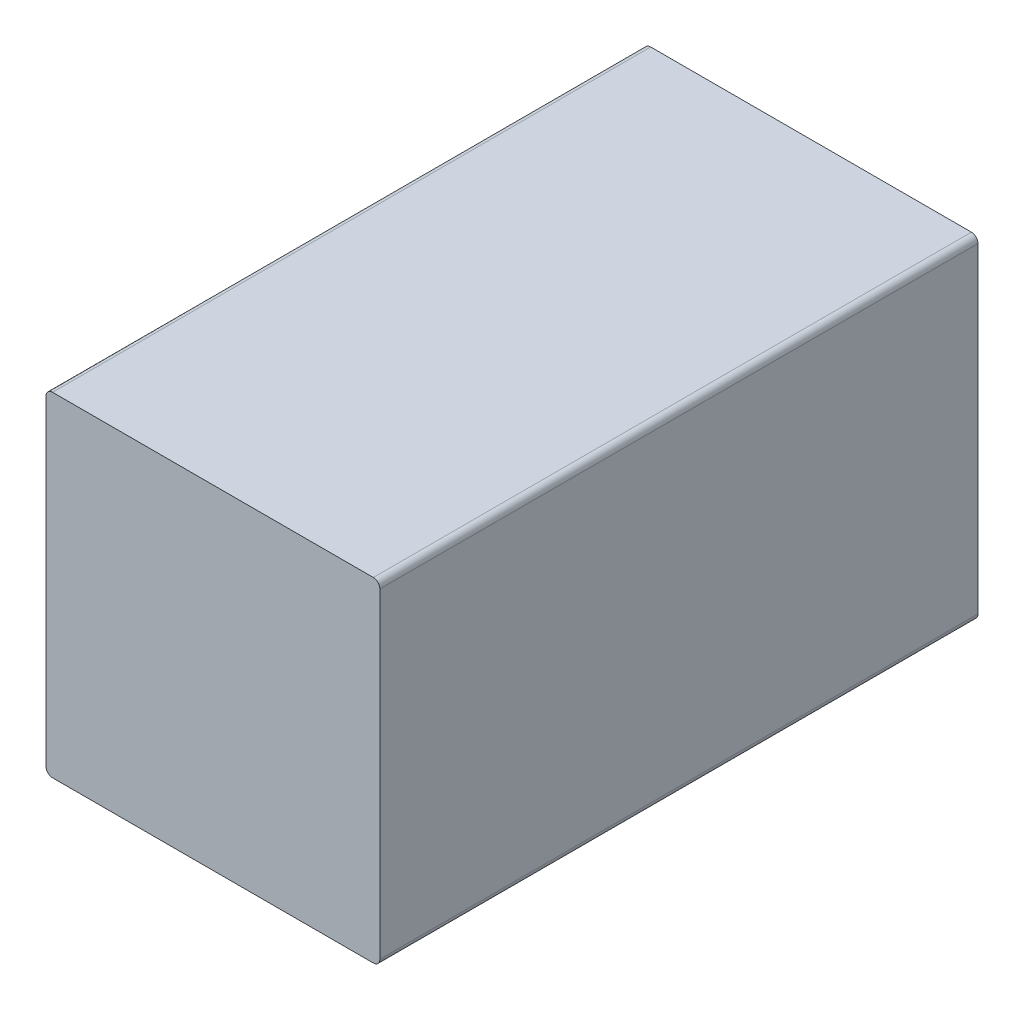
ISO-10303-21;
HEADER;
FILE_DESCRIPTION(('STEP AP214'),'2;1');
FILE_NAME('part.step','',(''),(''),'','','');
FILE_SCHEMA(('AUTOMOTIVE_DESIGN { 1 0 10303 214 1 1 1 1 }'));
ENDSEC;
DATA;
#1=APPLICATION_CONTEXT('core data for automotive mechanical design processes');
#2=APPLICATION_PROTOCOL_DEFINITION('international standard','automotive_design',2000,#1);
#3=PRODUCT_CONTEXT('',#1,'mechanical');
#4=PRODUCT('Part','Part','',(#3));
#5=PRODUCT_RELATED_PRODUCT_CATEGORY('part','',(#4));
#6=PRODUCT_DEFINITION_FORMATION('','',#4);
#7=PRODUCT_DEFINITION_CONTEXT('part definition',#1,'design');
#8=PRODUCT_DEFINITION('design','',#6,#7);
#9=PRODUCT_DEFINITION_SHAPE('','',#8);
#10=(LENGTH_UNIT() NAMED_UNIT(*) SI_UNIT(.MILLI.,.METRE.));
#11=(NAMED_UNIT(*) PLANE_ANGLE_UNIT() SI_UNIT($,.RADIAN.));
#12=(NAMED_UNIT(*) SI_UNIT($,.STERADIAN.) SOLID_ANGLE_UNIT());
#13=UNCERTAINTY_MEASURE_WITH_UNIT(LENGTH_MEASURE(1.E-05),#10,'distance_accuracy_value','');
#14=(GEOMETRIC_REPRESENTATION_CONTEXT(3) GLOBAL_UNCERTAINTY_ASSIGNED_CONTEXT((#13)) GLOBAL_UNIT_ASSIGNED_CONTEXT((#10,
#11,#12)) REPRESENTATION_CONTEXT('',''));
#15=CARTESIAN_POINT('',(0.,0.,0.));
#16=DIRECTION('',(0.,0.,1.));
#17=DIRECTION('',(1.,0.,0.));
#18=AXIS2_PLACEMENT_3D('',#15,#16,#17);
#19=CARTESIAN_POINT('',(0.,0.,1.));
#20=DIRECTION('',(0.,1.,0.));
#21=DIRECTION('',(0.,0.,1.));
#22=AXIS2_PLACEMENT_3D('',#19,#20,#21);
#23=PLANE('',#22);
#24=DIRECTION('',(1.,0.,0.));
#25=VECTOR('',#24,1.);
#26=CARTESIAN_POINT('',(0.,0.,-90.));
#27=LINE('',#26,#25);
#28=CARTESIAN_POINT('',(1.,0.,-90.));
#29=VERTEX_POINT('',#28);
#30=CARTESIAN_POINT('',(49.8,0.,-90.));
#31=VERTEX_POINT('',#30);
#32=EDGE_CURVE('E179',#29,#31,#27,.T.);
#33=ORIENTED_EDGE('',*,*,#32,.T.);
#34=DIRECTION('',(0.,0.,-1.));
#35=VECTOR('',#34,1.);
#36=CARTESIAN_POINT('',(49.8,0.,1.));
#37=LINE('',#36,#35);
#38=CARTESIAN_POINT('',(49.8,0.,1.));
#39=VERTEX_POINT('',#38);
#40=EDGE_CURVE('E11',#31,#39,#37,.F.);
#41=ORIENTED_EDGE('',*,*,#40,.T.);
#42=DIRECTION('',(1.,0.,0.));
#43=VECTOR('',#42,1.);
#44=CARTESIAN_POINT('',(0.,0.,1.));
#45=LINE('',#44,#43);
#46=CARTESIAN_POINT('',(1.,0.,1.));
#47=VERTEX_POINT('',#46);
#48=EDGE_CURVE('E182',#47,#39,#45,.T.);
#49=ORIENTED_EDGE('',*,*,#48,.F.);
#50=DIRECTION('',(0.,0.,-1.));
#51=VECTOR('',#50,1.);
#52=CARTESIAN_POINT('',(1.,0.,-90.));
#53=LINE('',#52,#51);
#54=EDGE_CURVE('E48',#47,#29,#53,.T.);
#55=ORIENTED_EDGE('',*,*,#54,.T.);
#56=EDGE_LOOP('',(#33,#41,#49,#55));
#57=FACE_BOUND('',#56,.T.);
#58=ADVANCED_FACE('F39',(#57),#23,.F.);
#59=CARTESIAN_POINT('',(50.8,0.,1.));
#60=DIRECTION('',(-1.,0.,0.));
#61=DIRECTION('',(0.,0.,1.));
#62=AXIS2_PLACEMENT_3D('',#59,#60,#61);
#63=PLANE('',#62);
#64=DIRECTION('',(0.,1.,0.));
#65=VECTOR('',#64,1.);
#66=CARTESIAN_POINT('',(50.8,0.,-90.));
#67=LINE('',#66,#65);
#68=CARTESIAN_POINT('',(50.8,1.,-90.));
#69=VERTEX_POINT('',#68);
#70=CARTESIAN_POINT('',(50.8,49.8,-90.));
#71=VERTEX_POINT('',#70);
#72=EDGE_CURVE('E258',#69,#71,#67,.T.);
#73=ORIENTED_EDGE('',*,*,#72,.T.);
#74=DIRECTION('',(0.,0.,-1.));
#75=VECTOR('',#74,1.);
#76=CARTESIAN_POINT('',(50.8,49.8,1.));
#77=LINE('',#76,#75);
#78=CARTESIAN_POINT('',(50.8,49.8,1.));
#79=VERTEX_POINT('',#78);
#80=EDGE_CURVE('E55',#71,#79,#77,.F.);
#81=ORIENTED_EDGE('',*,*,#80,.T.);
#82=DIRECTION('',(0.,1.,0.));
#83=VECTOR('',#82,1.);
#84=CARTESIAN_POINT('',(50.8,0.,1.));
#85=LINE('',#84,#83);
#86=CARTESIAN_POINT('',(50.8,1.,1.));
#87=VERTEX_POINT('',#86);
#88=EDGE_CURVE('E190',#87,#79,#85,.T.);
#89=ORIENTED_EDGE('',*,*,#88,.F.);
#90=DIRECTION('',(0.,0.,-1.));
#91=VECTOR('',#90,1.);
#92=CARTESIAN_POINT('',(50.8,1.,1.));
#93=LINE('',#92,#91);
#94=EDGE_CURVE('E238',#87,#69,#93,.T.);
#95=ORIENTED_EDGE('',*,*,#94,.T.);
#96=EDGE_LOOP('',(#73,#81,#89,#95));
#97=FACE_BOUND('',#96,.T.);
#98=ADVANCED_FACE('F285',(#97),#63,.F.);
#99=CARTESIAN_POINT('',(0.,50.8,1.));
#100=DIRECTION('',(0.,1.,0.));
#101=DIRECTION('',(0.,0.,1.));
#102=AXIS2_PLACEMENT_3D('',#99,#100,#101);
#103=PLANE('',#102);
#104=DIRECTION('',(1.,0.,0.));
#105=VECTOR('',#104,1.);
#106=CARTESIAN_POINT('',(0.,50.8,-90.));
#107=LINE('',#106,#105);
#108=CARTESIAN_POINT('',(1.,50.8,-90.));
#109=VERTEX_POINT('',#108);
#110=CARTESIAN_POINT('',(49.8,50.8,-90.));
#111=VERTEX_POINT('',#110);
#112=EDGE_CURVE('E261',#109,#111,#107,.T.);
#113=ORIENTED_EDGE('',*,*,#112,.F.);
#114=DIRECTION('',(0.,0.,-1.));
#115=VECTOR('',#114,1.);
#116=CARTESIAN_POINT('',(1.,50.8,1.));
#117=LINE('',#116,#115);
#118=CARTESIAN_POINT('',(1.,50.8,1.));
#119=VERTEX_POINT('',#118);
#120=EDGE_CURVE('E224',#109,#119,#117,.F.);
#121=ORIENTED_EDGE('',*,*,#120,.T.);
#122=DIRECTION('',(1.,0.,0.));
#123=VECTOR('',#122,1.);
#124=CARTESIAN_POINT('',(0.,50.8,1.));
#125=LINE('',#124,#123);
#126=CARTESIAN_POINT('',(49.8,50.8,1.));
#127=VERTEX_POINT('',#126);
#128=EDGE_CURVE('E193',#119,#127,#125,.T.);
#129=ORIENTED_EDGE('',*,*,#128,.T.);
#130=DIRECTION('',(0.,0.,-1.));
#131=VECTOR('',#130,1.);
#132=CARTESIAN_POINT('',(49.8,50.8,-90.));
#133=LINE('',#132,#131);
#134=EDGE_CURVE('E220',#127,#111,#133,.T.);
#135=ORIENTED_EDGE('',*,*,#134,.T.);
#136=EDGE_LOOP('',(#113,#121,#129,#135));
#137=FACE_BOUND('',#136,.T.);
#138=ADVANCED_FACE('F280',(#137),#103,.T.);
#139=CARTESIAN_POINT('',(0.,0.,1.));
#140=DIRECTION('',(-1.,0.,0.));
#141=DIRECTION('',(0.,0.,1.));
#142=AXIS2_PLACEMENT_3D('',#139,#140,#141);
#143=PLANE('',#142);
#144=DIRECTION('',(0.,1.,0.));
#145=VECTOR('',#144,1.);
#146=CARTESIAN_POINT('',(0.,0.,1.));
#147=LINE('',#146,#145);
#148=CARTESIAN_POINT('',(0.,1.,1.));
#149=VERTEX_POINT('',#148);
#150=CARTESIAN_POINT('',(0.,49.8,1.));
#151=VERTEX_POINT('',#150);
#152=EDGE_CURVE('E197',#149,#151,#147,.T.);
#153=ORIENTED_EDGE('',*,*,#152,.T.);
#154=DIRECTION('',(0.,0.,-1.));
#155=VECTOR('',#154,1.);
#156=CARTESIAN_POINT('',(0.,49.8,1.));
#157=LINE('',#156,#155);
#158=CARTESIAN_POINT('',(0.,49.8,-90.));
#159=VERTEX_POINT('',#158);
#160=EDGE_CURVE('E204',#151,#159,#157,.T.);
#161=ORIENTED_EDGE('',*,*,#160,.T.);
#162=DIRECTION('',(0.,1.,0.));
#163=VECTOR('',#162,1.);
#164=CARTESIAN_POINT('',(0.,0.,-90.));
#165=LINE('',#164,#163);
#166=CARTESIAN_POINT('',(0.,1.,-90.));
#167=VERTEX_POINT('',#166);
#168=EDGE_CURVE('E152',#167,#159,#165,.T.);
#169=ORIENTED_EDGE('',*,*,#168,.F.);
#170=DIRECTION('',(0.,0.,-1.));
#171=VECTOR('',#170,1.);
#172=CARTESIAN_POINT('',(0.,1.,1.));
#173=LINE('',#172,#171);
#174=EDGE_CURVE('E201',#167,#149,#173,.F.);
#175=ORIENTED_EDGE('',*,*,#174,.T.);
#176=EDGE_LOOP('',(#153,#161,#169,#175));
#177=FACE_BOUND('',#176,.T.);
#178=ADVANCED_FACE('F270',(#177),#143,.T.);
#179=CARTESIAN_POINT('',(0.,0.,1.));
#180=DIRECTION('',(0.,0.,1.));
#181=DIRECTION('',(1.,0.,0.));
#182=AXIS2_PLACEMENT_3D('',#179,#180,#181);
#183=PLANE('',#182);
#184=ORIENTED_EDGE('',*,*,#128,.F.);
#185=CARTESIAN_POINT('',(1.,49.8,1.));
#186=DIRECTION('',(0.,0.,1.));
#187=DIRECTION('',(1.,0.,0.));
#188=AXIS2_PLACEMENT_3D('',#185,#186,#187);
#189=CIRCLE('',#188,1.);
#190=EDGE_CURVE('E235',#119,#151,#189,.T.);
#191=ORIENTED_EDGE('',*,*,#190,.T.);
#192=ORIENTED_EDGE('',*,*,#152,.F.);
#193=CARTESIAN_POINT('',(1.,1.,1.));
#194=DIRECTION('',(0.,0.,1.));
#195=DIRECTION('',(1.,0.,0.));
#196=AXIS2_PLACEMENT_3D('',#193,#194,#195);
#197=CIRCLE('',#196,1.);
#198=EDGE_CURVE('E227',#149,#47,#197,.T.);
#199=ORIENTED_EDGE('',*,*,#198,.T.);
#200=ORIENTED_EDGE('',*,*,#48,.T.);
#201=CARTESIAN_POINT('',(49.8,1.,1.));
#202=DIRECTION('',(0.,0.,1.));
#203=DIRECTION('',(1.,0.,0.));
#204=AXIS2_PLACEMENT_3D('',#201,#202,#203);
#205=CIRCLE('',#204,1.);
#206=EDGE_CURVE('E62',#39,#87,#205,.T.);
#207=ORIENTED_EDGE('',*,*,#206,.T.);
#208=ORIENTED_EDGE('',*,*,#88,.T.);
#209=CARTESIAN_POINT('',(49.8,49.8,1.));
#210=DIRECTION('',(0.,0.,1.));
#211=DIRECTION('',(1.,0.,0.));
#212=AXIS2_PLACEMENT_3D('',#209,#210,#211);
#213=CIRCLE('',#212,1.);
#214=EDGE_CURVE('E232',#79,#127,#213,.T.);
#215=ORIENTED_EDGE('',*,*,#214,.T.);
#216=EDGE_LOOP('',(#184,#191,#192,#199,#200,#207,#208,#215));
#217=FACE_BOUND('',#216,.T.);
#218=ADVANCED_FACE('F274',(#217),#183,.T.);
#219=CARTESIAN_POINT('',(0.,2.,-90.));
#220=DIRECTION('',(0.,-1.,0.));
#221=DIRECTION('',(0.,0.,-1.));
#222=AXIS2_PLACEMENT_3D('',#219,#220,#221);
#223=PLANE('',#222);
#224=DIRECTION('',(1.,0.,0.));
#225=VECTOR('',#224,1.);
#226=CARTESIAN_POINT('',(0.,2.,0.));
#227=LINE('',#226,#225);
#228=CARTESIAN_POINT('',(2.,2.,0.));
#229=VERTEX_POINT('',#228);
#230=CARTESIAN_POINT('',(48.8,2.,0.));
#231=VERTEX_POINT('',#230);
#232=EDGE_CURVE('E166',#229,#231,#227,.T.);
#233=ORIENTED_EDGE('',*,*,#232,.T.);
#234=DIRECTION('',(0.,0.,1.));
#235=VECTOR('',#234,1.);
#236=CARTESIAN_POINT('',(48.8,2.,-90.));
#237=LINE('',#236,#235);
#238=CARTESIAN_POINT('',(48.8,2.,-90.));
#239=VERTEX_POINT('',#238);
#240=EDGE_CURVE('E149',#239,#231,#237,.T.);
#241=ORIENTED_EDGE('',*,*,#240,.F.);
#242=DIRECTION('',(1.,0.,0.));
#243=VECTOR('',#242,1.);
#244=CARTESIAN_POINT('',(0.,2.,-90.));
#245=LINE('',#244,#243);
#246=CARTESIAN_POINT('',(2.,2.,-90.));
#247=VERTEX_POINT('',#246);
#248=EDGE_CURVE('E147',#247,#239,#245,.T.);
#249=ORIENTED_EDGE('',*,*,#248,.F.);
#250=DIRECTION('',(0.,0.,1.));
#251=VECTOR('',#250,1.);
#252=CARTESIAN_POINT('',(2.,2.,-90.));
#253=LINE('',#252,#251);
#254=EDGE_CURVE('E130',#247,#229,#253,.T.);
#255=ORIENTED_EDGE('',*,*,#254,.T.);
#256=EDGE_LOOP('',(#233,#241,#249,#255));
#257=FACE_BOUND('',#256,.T.);
#258=ADVANCED_FACE('F148',(#257),#223,.F.);
#259=CARTESIAN_POINT('',(48.8,0.,-90.));
#260=DIRECTION('',(1.,0.,0.));
#261=DIRECTION('',(0.,0.,-1.));
#262=AXIS2_PLACEMENT_3D('',#259,#260,#261);
#263=PLANE('',#262);
#264=DIRECTION('',(0.,1.,0.));
#265=VECTOR('',#264,1.);
#266=CARTESIAN_POINT('',(48.8,0.,0.));
#267=LINE('',#266,#265);
#268=CARTESIAN_POINT('',(48.8,48.8,0.));
#269=VERTEX_POINT('',#268);
#270=EDGE_CURVE('E175',#231,#269,#267,.T.);
#271=ORIENTED_EDGE('',*,*,#270,.T.);
#272=DIRECTION('',(0.,0.,1.));
#273=VECTOR('',#272,1.);
#274=CARTESIAN_POINT('',(48.8,48.8,-90.));
#275=LINE('',#274,#273);
#276=CARTESIAN_POINT('',(48.8,48.8,-90.));
#277=VERTEX_POINT('',#276);
#278=EDGE_CURVE('E183',#277,#269,#275,.T.);
#279=ORIENTED_EDGE('',*,*,#278,.F.);
#280=DIRECTION('',(0.,1.,0.));
#281=VECTOR('',#280,1.);
#282=CARTESIAN_POINT('',(48.8,0.,-90.));
#283=LINE('',#282,#281);
#284=EDGE_CURVE('E143',#239,#277,#283,.T.);
#285=ORIENTED_EDGE('',*,*,#284,.F.);
#286=ORIENTED_EDGE('',*,*,#240,.T.);
#287=EDGE_LOOP('',(#271,#279,#285,#286));
#288=FACE_BOUND('',#287,.T.);
#289=ADVANCED_FACE('F339',(#288),#263,.F.);
#290=CARTESIAN_POINT('',(0.,48.8,-90.));
#291=DIRECTION('',(0.,-1.,0.));
#292=DIRECTION('',(0.,0.,-1.));
#293=AXIS2_PLACEMENT_3D('',#290,#291,#292);
#294=PLANE('',#293);
#295=DIRECTION('',(1.,0.,0.));
#296=VECTOR('',#295,1.);
#297=CARTESIAN_POINT('',(0.,48.8,0.));
#298=LINE('',#297,#296);
#299=CARTESIAN_POINT('',(2.,48.8,0.));
#300=VERTEX_POINT('',#299);
#301=EDGE_CURVE('E171',#300,#269,#298,.T.);
#302=ORIENTED_EDGE('',*,*,#301,.F.);
#303=DIRECTION('',(0.,0.,1.));
#304=VECTOR('',#303,1.);
#305=CARTESIAN_POINT('',(2.,48.8,-90.));
#306=LINE('',#305,#304);
#307=CARTESIAN_POINT('',(2.,48.8,-90.));
#308=VERTEX_POINT('',#307);
#309=EDGE_CURVE('E142',#308,#300,#306,.T.);
#310=ORIENTED_EDGE('',*,*,#309,.F.);
#311=DIRECTION('',(1.,0.,0.));
#312=VECTOR('',#311,1.);
#313=CARTESIAN_POINT('',(0.,48.8,-90.));
#314=LINE('',#313,#312);
#315=EDGE_CURVE('E157',#308,#277,#314,.T.);
#316=ORIENTED_EDGE('',*,*,#315,.T.);
#317=ORIENTED_EDGE('',*,*,#278,.T.);
#318=EDGE_LOOP('',(#302,#310,#316,#317));
#319=FACE_BOUND('',#318,.T.);
#320=ADVANCED_FACE('F345',(#319),#294,.T.);
#321=CARTESIAN_POINT('',(2.,0.,-90.));
#322=DIRECTION('',(1.,0.,0.));
#323=DIRECTION('',(0.,0.,-1.));
#324=AXIS2_PLACEMENT_3D('',#321,#322,#323);
#325=PLANE('',#324);
#326=DIRECTION('',(0.,1.,0.));
#327=VECTOR('',#326,1.);
#328=CARTESIAN_POINT('',(2.,0.,0.));
#329=LINE('',#328,#327);
#330=EDGE_CURVE('E137',#229,#300,#329,.T.);
#331=ORIENTED_EDGE('',*,*,#330,.F.);
#332=ORIENTED_EDGE('',*,*,#254,.F.);
#333=DIRECTION('',(0.,1.,0.));
#334=VECTOR('',#333,1.);
#335=CARTESIAN_POINT('',(2.,0.,-90.));
#336=LINE('',#335,#334);
#337=EDGE_CURVE('E135',#247,#308,#336,.T.);
#338=ORIENTED_EDGE('',*,*,#337,.T.);
#339=ORIENTED_EDGE('',*,*,#309,.T.);
#340=EDGE_LOOP('',(#331,#332,#338,#339));
#341=FACE_BOUND('',#340,.T.);
#342=ADVANCED_FACE('F132',(#341),#325,.T.);
#343=CARTESIAN_POINT('',(0.,0.,-90.));
#344=DIRECTION('',(0.,0.,1.));
#345=DIRECTION('',(1.,0.,0.));
#346=AXIS2_PLACEMENT_3D('',#343,#344,#345);
#347=PLANE('',#346);
#348=ORIENTED_EDGE('',*,*,#168,.T.);
#349=CARTESIAN_POINT('',(1.,49.8,-90.));
#350=DIRECTION('',(0.,0.,1.));
#351=DIRECTION('',(1.,0.,0.));
#352=AXIS2_PLACEMENT_3D('',#349,#350,#351);
#353=CIRCLE('',#352,1.);
#354=EDGE_CURVE('E217',#159,#109,#353,.F.);
#355=ORIENTED_EDGE('',*,*,#354,.T.);
#356=ORIENTED_EDGE('',*,*,#112,.T.);
#357=CARTESIAN_POINT('',(49.8,49.8,-90.));
#358=DIRECTION('',(0.,0.,1.));
#359=DIRECTION('',(1.,0.,0.));
#360=AXIS2_PLACEMENT_3D('',#357,#358,#359);
#361=CIRCLE('',#360,1.);
#362=EDGE_CURVE('E214',#111,#71,#361,.F.);
#363=ORIENTED_EDGE('',*,*,#362,.T.);
#364=ORIENTED_EDGE('',*,*,#72,.F.);
#365=CARTESIAN_POINT('',(49.8,1.,-90.));
#366=DIRECTION('',(0.,0.,1.));
#367=DIRECTION('',(1.,0.,0.));
#368=AXIS2_PLACEMENT_3D('',#365,#366,#367);
#369=CIRCLE('',#368,1.);
#370=EDGE_CURVE('E211',#69,#31,#369,.F.);
#371=ORIENTED_EDGE('',*,*,#370,.T.);
#372=ORIENTED_EDGE('',*,*,#32,.F.);
#373=CARTESIAN_POINT('',(1.,1.,-90.));
#374=DIRECTION('',(0.,0.,1.));
#375=DIRECTION('',(1.,0.,0.));
#376=AXIS2_PLACEMENT_3D('',#373,#374,#375);
#377=CIRCLE('',#376,1.);
#378=EDGE_CURVE('E208',#29,#167,#377,.F.);
#379=ORIENTED_EDGE('',*,*,#378,.T.);
#380=EDGE_LOOP('',(#348,#355,#356,#363,#364,#371,#372,#379));
#381=FACE_BOUND('',#380,.T.);
#382=ORIENTED_EDGE('',*,*,#248,.T.);
#383=ORIENTED_EDGE('',*,*,#284,.T.);
#384=ORIENTED_EDGE('',*,*,#315,.F.);
#385=ORIENTED_EDGE('',*,*,#337,.F.);
#386=EDGE_LOOP('',(#382,#383,#384,#385));
#387=FACE_BOUND('',#386,.T.);
#388=ADVANCED_FACE('F155',(#381,#387),#347,.F.);
#389=CARTESIAN_POINT('',(0.,0.,0.));
#390=DIRECTION('',(0.,0.,1.));
#391=DIRECTION('',(1.,0.,0.));
#392=AXIS2_PLACEMENT_3D('',#389,#390,#391);
#393=PLANE('',#392);
#394=ORIENTED_EDGE('',*,*,#232,.F.);
#395=ORIENTED_EDGE('',*,*,#330,.T.);
#396=ORIENTED_EDGE('',*,*,#301,.T.);
#397=ORIENTED_EDGE('',*,*,#270,.F.);
#398=EDGE_LOOP('',(#394,#395,#396,#397));
#399=FACE_BOUND('',#398,.T.);
#400=ADVANCED_FACE('F304',(#399),#393,.F.);
#401=CARTESIAN_POINT('',(1.,49.8,1.));
#402=DIRECTION('',(0.,0.,-1.));
#403=DIRECTION('',(-1.,0.,0.));
#404=AXIS2_PLACEMENT_3D('',#401,#402,#403);
#405=CYLINDRICAL_SURFACE('',#404,1.);
#406=ORIENTED_EDGE('',*,*,#190,.F.);
#407=ORIENTED_EDGE('',*,*,#120,.F.);
#408=ORIENTED_EDGE('',*,*,#354,.F.);
#409=ORIENTED_EDGE('',*,*,#160,.F.);
#410=EDGE_LOOP('',(#406,#407,#408,#409));
#411=FACE_BOUND('',#410,.T.);
#412=ADVANCED_FACE('F277',(#411),#405,.T.);
#413=CARTESIAN_POINT('',(49.8,49.8,1.));
#414=DIRECTION('',(0.,0.,1.));
#415=DIRECTION('',(1.,0.,0.));
#416=AXIS2_PLACEMENT_3D('',#413,#414,#415);
#417=CYLINDRICAL_SURFACE('',#416,1.);
#418=ORIENTED_EDGE('',*,*,#214,.F.);
#419=ORIENTED_EDGE('',*,*,#80,.F.);
#420=ORIENTED_EDGE('',*,*,#362,.F.);
#421=ORIENTED_EDGE('',*,*,#134,.F.);
#422=EDGE_LOOP('',(#418,#419,#420,#421));
#423=FACE_BOUND('',#422,.T.);
#424=ADVANCED_FACE('F284',(#423),#417,.T.);
#425=CARTESIAN_POINT('',(49.8,1.,1.));
#426=DIRECTION('',(0.,0.,-1.));
#427=DIRECTION('',(-1.,0.,0.));
#428=AXIS2_PLACEMENT_3D('',#425,#426,#427);
#429=CYLINDRICAL_SURFACE('',#428,1.);
#430=ORIENTED_EDGE('',*,*,#206,.F.);
#431=ORIENTED_EDGE('',*,*,#40,.F.);
#432=ORIENTED_EDGE('',*,*,#370,.F.);
#433=ORIENTED_EDGE('',*,*,#94,.F.);
#434=EDGE_LOOP('',(#430,#431,#432,#433));
#435=FACE_BOUND('',#434,.T.);
#436=ADVANCED_FACE('F288',(#435),#429,.T.);
#437=CARTESIAN_POINT('',(1.,1.,1.));
#438=DIRECTION('',(0.,0.,1.));
#439=DIRECTION('',(1.,0.,0.));
#440=AXIS2_PLACEMENT_3D('',#437,#438,#439);
#441=CYLINDRICAL_SURFACE('',#440,1.);
#442=ORIENTED_EDGE('',*,*,#198,.F.);
#443=ORIENTED_EDGE('',*,*,#174,.F.);
#444=ORIENTED_EDGE('',*,*,#378,.F.);
#445=ORIENTED_EDGE('',*,*,#54,.F.);
#446=EDGE_LOOP('',(#442,#443,#444,#445));
#447=FACE_BOUND('',#446,.T.);
#448=ADVANCED_FACE('F41',(#447),#441,.T.);
#449=CLOSED_SHELL('',(#58,#98,#138,#178,#218,#258,#289,#320,#342,#388,#400,#412,#424,#436,#448));
#450=MANIFOLD_SOLID_BREP('B2',#449);
#451=ADVANCED_BREP_SHAPE_REPRESENTATION('',(#18,#450),#14);
#452=SHAPE_DEFINITION_REPRESENTATION(#9,#451);
ENDSEC;
END-ISO-10303-21;
